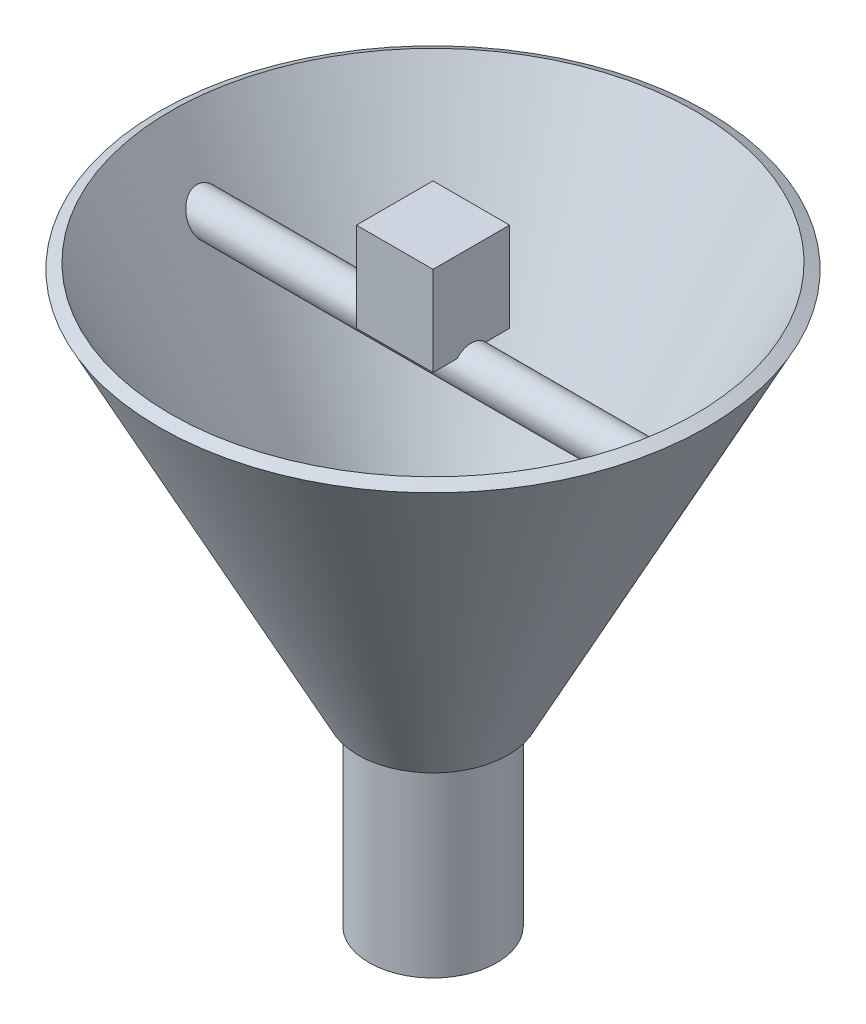
ISO-10303-21;
HEADER;
FILE_DESCRIPTION(('STEP AP214'),'2;1');
FILE_NAME('part.step','',(''),(''),'','','');
FILE_SCHEMA(('AUTOMOTIVE_DESIGN { 1 0 10303 214 1 1 1 1 }'));
ENDSEC;
DATA;
#1=APPLICATION_CONTEXT('core data for automotive mechanical design processes');
#2=APPLICATION_PROTOCOL_DEFINITION('international standard','automotive_design',2000,#1);
#3=PRODUCT_CONTEXT('',#1,'mechanical');
#4=PRODUCT('Part','Part','',(#3));
#5=PRODUCT_RELATED_PRODUCT_CATEGORY('part','',(#4));
#6=PRODUCT_DEFINITION_FORMATION('','',#4);
#7=PRODUCT_DEFINITION_CONTEXT('part definition',#1,'design');
#8=PRODUCT_DEFINITION('design','',#6,#7);
#9=PRODUCT_DEFINITION_SHAPE('','',#8);
#10=(LENGTH_UNIT() NAMED_UNIT(*) SI_UNIT(.MILLI.,.METRE.));
#11=(NAMED_UNIT(*) PLANE_ANGLE_UNIT() SI_UNIT($,.RADIAN.));
#12=(NAMED_UNIT(*) SI_UNIT($,.STERADIAN.) SOLID_ANGLE_UNIT());
#13=UNCERTAINTY_MEASURE_WITH_UNIT(LENGTH_MEASURE(1.E-05),#10,'distance_accuracy_value','');
#14=(GEOMETRIC_REPRESENTATION_CONTEXT(3) GLOBAL_UNCERTAINTY_ASSIGNED_CONTEXT((#13)) GLOBAL_UNIT_ASSIGNED_CONTEXT((#10,
#11,#12)) REPRESENTATION_CONTEXT('',''));
#15=CARTESIAN_POINT('',(0.,0.,0.));
#16=DIRECTION('',(0.,0.,1.));
#17=DIRECTION('',(1.,0.,0.));
#18=AXIS2_PLACEMENT_3D('',#15,#16,#17);
#19=CARTESIAN_POINT('',(0.,0.,0.));
#20=DIRECTION('',(0.,-1.,0.));
#21=DIRECTION('',(0.,0.,-1.));
#22=AXIS2_PLACEMENT_3D('',#19,#20,#21);
#23=PLANE('',#22);
#24=CARTESIAN_POINT('',(0.,0.,0.));
#25=DIRECTION('',(0.,-1.,0.));
#26=DIRECTION('',(0.,0.,-1.));
#27=AXIS2_PLACEMENT_3D('',#24,#25,#26);
#28=CIRCLE('',#27,4.5);
#29=CARTESIAN_POINT('',(0.,0.,-4.5));
#30=VERTEX_POINT('',#29);
#31=EDGE_CURVE('E75',#30,#30,#28,.T.);
#32=ORIENTED_EDGE('',*,*,#31,.T.);
#33=EDGE_LOOP('',(#32));
#34=FACE_BOUND('',#33,.T.);
#35=CARTESIAN_POINT('',(0.,0.,0.));
#36=DIRECTION('',(0.,1.,0.));
#37=DIRECTION('',(0.,0.,1.));
#38=AXIS2_PLACEMENT_3D('',#35,#36,#37);
#39=CIRCLE('',#38,5.);
#40=CARTESIAN_POINT('',(0.,0.,5.));
#41=VERTEX_POINT('',#40);
#42=EDGE_CURVE('E71',#41,#41,#39,.T.);
#43=ORIENTED_EDGE('',*,*,#42,.T.);
#44=EDGE_LOOP('',(#43));
#45=FACE_BOUND('',#44,.T.);
#46=ADVANCED_FACE('F65',(#34,#45),#23,.F.);
#47=CARTESIAN_POINT('',(0.,-15.,0.));
#48=DIRECTION('',(0.,-1.,0.));
#49=DIRECTION('',(0.,0.,-1.));
#50=AXIS2_PLACEMENT_3D('',#47,#48,#49);
#51=PLANE('',#50);
#52=CARTESIAN_POINT('',(0.,-15.,0.));
#53=DIRECTION('',(0.,-1.,0.));
#54=DIRECTION('',(0.,0.,-1.));
#55=AXIS2_PLACEMENT_3D('',#52,#53,#54);
#56=CIRCLE('',#55,4.5);
#57=CARTESIAN_POINT('',(0.,-15.,-4.5));
#58=VERTEX_POINT('',#57);
#59=EDGE_CURVE('E79',#58,#58,#56,.T.);
#60=ORIENTED_EDGE('',*,*,#59,.F.);
#61=EDGE_LOOP('',(#60));
#62=FACE_BOUND('',#61,.T.);
#63=CARTESIAN_POINT('',(0.,-15.,0.));
#64=DIRECTION('',(0.,1.,0.));
#65=DIRECTION('',(0.,0.,1.));
#66=AXIS2_PLACEMENT_3D('',#63,#64,#65);
#67=CIRCLE('',#66,5.);
#68=CARTESIAN_POINT('',(0.,-15.,5.));
#69=VERTEX_POINT('',#68);
#70=EDGE_CURVE('E12',#69,#69,#67,.T.);
#71=ORIENTED_EDGE('',*,*,#70,.F.);
#72=EDGE_LOOP('',(#71));
#73=FACE_BOUND('',#72,.T.);
#74=ADVANCED_FACE('F87',(#62,#73),#51,.T.);
#75=CARTESIAN_POINT('',(0.,0.,0.));
#76=DIRECTION('',(0.,-1.,0.));
#77=DIRECTION('',(0.,0.,-1.));
#78=AXIS2_PLACEMENT_3D('',#75,#76,#77);
#79=CYLINDRICAL_SURFACE('',#78,5.);
#80=ORIENTED_EDGE('',*,*,#42,.F.);
#81=EDGE_LOOP('',(#80));
#82=FACE_BOUND('',#81,.T.);
#83=ORIENTED_EDGE('',*,*,#70,.T.);
#84=EDGE_LOOP('',(#83));
#85=FACE_BOUND('',#84,.T.);
#86=ADVANCED_FACE('F90',(#82,#85),#79,.T.);
#87=CARTESIAN_POINT('',(0.,0.,0.));
#88=DIRECTION('',(0.,-1.,0.));
#89=DIRECTION('',(0.,0.,-1.));
#90=AXIS2_PLACEMENT_3D('',#87,#88,#89);
#91=CYLINDRICAL_SURFACE('',#90,4.5);
#92=ORIENTED_EDGE('',*,*,#31,.F.);
#93=EDGE_LOOP('',(#92));
#94=FACE_BOUND('',#93,.T.);
#95=ORIENTED_EDGE('',*,*,#59,.T.);
#96=EDGE_LOOP('',(#95));
#97=FACE_BOUND('',#96,.T.);
#98=ADVANCED_FACE('F85',(#94,#97),#91,.F.);
#99=CLOSED_SHELL('',(#46,#74,#86,#98));
#100=MANIFOLD_SOLID_BREP('B2',#99);
#101=CARTESIAN_POINT('',(-3.,25.539732044708,-3.));
#102=DIRECTION('',(0.,0.,-1.));
#103=DIRECTION('',(-1.,0.,0.));
#104=AXIS2_PLACEMENT_3D('',#101,#102,#103);
#105=PLANE('',#104);
#106=DIRECTION('',(1.,0.,0.));
#107=VECTOR('',#106,1.);
#108=CARTESIAN_POINT('',(-3.,32.539732044708,-3.));
#109=LINE('',#108,#107);
#110=CARTESIAN_POINT('',(-3.,32.539732044708,-3.));
#111=VERTEX_POINT('',#110);
#112=CARTESIAN_POINT('',(3.,32.539732044708,-3.));
#113=VERTEX_POINT('',#112);
#114=EDGE_CURVE('E137',#111,#113,#109,.T.);
#115=ORIENTED_EDGE('',*,*,#114,.T.);
#116=DIRECTION('',(0.,1.,0.));
#117=VECTOR('',#116,1.);
#118=CARTESIAN_POINT('',(3.,25.539732044708,-3.));
#119=LINE('',#118,#117);
#120=CARTESIAN_POINT('',(3.,25.539732044708,-3.));
#121=VERTEX_POINT('',#120);
#122=EDGE_CURVE('E174',#121,#113,#119,.T.);
#123=ORIENTED_EDGE('',*,*,#122,.F.);
#124=DIRECTION('',(1.,0.,0.));
#125=VECTOR('',#124,1.);
#126=CARTESIAN_POINT('',(-3.,25.539732044708,-3.));
#127=LINE('',#126,#125);
#128=CARTESIAN_POINT('',(-3.,25.539732044708,-3.));
#129=VERTEX_POINT('',#128);
#130=EDGE_CURVE('E63',#129,#121,#127,.T.);
#131=ORIENTED_EDGE('',*,*,#130,.F.);
#132=DIRECTION('',(0.,1.,0.));
#133=VECTOR('',#132,1.);
#134=CARTESIAN_POINT('',(-3.,25.539732044708,-3.));
#135=LINE('',#134,#133);
#136=EDGE_CURVE('E175',#129,#111,#135,.T.);
#137=ORIENTED_EDGE('',*,*,#136,.T.);
#138=EDGE_LOOP('',(#115,#123,#131,#137));
#139=FACE_BOUND('',#138,.T.);
#140=ADVANCED_FACE('F134',(#139),#105,.T.);
#141=CARTESIAN_POINT('',(-3.,25.539732044708,-3.));
#142=DIRECTION('',(0.,-1.,0.));
#143=DIRECTION('',(0.,0.,-1.));
#144=AXIS2_PLACEMENT_3D('',#141,#142,#143);
#145=PLANE('',#144);
#146=ORIENTED_EDGE('',*,*,#130,.T.);
#147=DIRECTION('',(0.,0.,-1.));
#148=VECTOR('',#147,1.);
#149=CARTESIAN_POINT('',(3.,25.539732044708,-3.));
#150=LINE('',#149,#148);
#151=CARTESIAN_POINT('',(3.,25.539732044708,3.));
#152=VERTEX_POINT('',#151);
#153=EDGE_CURVE('E191',#152,#121,#150,.T.);
#154=ORIENTED_EDGE('',*,*,#153,.F.);
#155=DIRECTION('',(1.,0.,0.));
#156=VECTOR('',#155,1.);
#157=CARTESIAN_POINT('',(-3.,25.539732044708,3.));
#158=LINE('',#157,#156);
#159=CARTESIAN_POINT('',(-3.,25.539732044708,3.));
#160=VERTEX_POINT('',#159);
#161=EDGE_CURVE('E142',#160,#152,#158,.T.);
#162=ORIENTED_EDGE('',*,*,#161,.F.);
#163=DIRECTION('',(0.,0.,-1.));
#164=VECTOR('',#163,1.);
#165=CARTESIAN_POINT('',(-3.,25.539732044708,-3.));
#166=LINE('',#165,#164);
#167=EDGE_CURVE('E180',#160,#129,#166,.T.);
#168=ORIENTED_EDGE('',*,*,#167,.T.);
#169=EDGE_LOOP('',(#146,#154,#162,#168));
#170=FACE_BOUND('',#169,.T.);
#171=ADVANCED_FACE('F206',(#170),#145,.T.);
#172=CARTESIAN_POINT('',(-3.,25.539732044708,3.));
#173=DIRECTION('',(0.,0.,1.));
#174=DIRECTION('',(0.,-1.,0.));
#175=AXIS2_PLACEMENT_3D('',#172,#173,#174);
#176=PLANE('',#175);
#177=ORIENTED_EDGE('',*,*,#161,.T.);
#178=DIRECTION('',(0.,-1.,0.));
#179=VECTOR('',#178,1.);
#180=CARTESIAN_POINT('',(3.,25.539732044708,3.));
#181=LINE('',#180,#179);
#182=CARTESIAN_POINT('',(3.,32.539732044708,3.));
#183=VERTEX_POINT('',#182);
#184=EDGE_CURVE('E187',#183,#152,#181,.T.);
#185=ORIENTED_EDGE('',*,*,#184,.F.);
#186=DIRECTION('',(1.,0.,0.));
#187=VECTOR('',#186,1.);
#188=CARTESIAN_POINT('',(-3.,32.539732044708,3.));
#189=LINE('',#188,#187);
#190=CARTESIAN_POINT('',(-3.,32.539732044708,3.));
#191=VERTEX_POINT('',#190);
#192=EDGE_CURVE('E179',#191,#183,#189,.T.);
#193=ORIENTED_EDGE('',*,*,#192,.F.);
#194=DIRECTION('',(0.,-1.,0.));
#195=VECTOR('',#194,1.);
#196=CARTESIAN_POINT('',(-3.,25.539732044708,3.));
#197=LINE('',#196,#195);
#198=EDGE_CURVE('E199',#191,#160,#197,.T.);
#199=ORIENTED_EDGE('',*,*,#198,.T.);
#200=EDGE_LOOP('',(#177,#185,#193,#199));
#201=FACE_BOUND('',#200,.T.);
#202=ADVANCED_FACE('F203',(#201),#176,.T.);
#203=CARTESIAN_POINT('',(-3.,32.539732044708,-3.));
#204=DIRECTION('',(0.,1.,0.));
#205=DIRECTION('',(0.,0.,1.));
#206=AXIS2_PLACEMENT_3D('',#203,#204,#205);
#207=PLANE('',#206);
#208=ORIENTED_EDGE('',*,*,#192,.T.);
#209=DIRECTION('',(0.,0.,1.));
#210=VECTOR('',#209,1.);
#211=CARTESIAN_POINT('',(3.,32.539732044708,-3.));
#212=LINE('',#211,#210);
#213=EDGE_CURVE('E182',#113,#183,#212,.T.);
#214=ORIENTED_EDGE('',*,*,#213,.F.);
#215=ORIENTED_EDGE('',*,*,#114,.F.);
#216=DIRECTION('',(0.,0.,1.));
#217=VECTOR('',#216,1.);
#218=CARTESIAN_POINT('',(-3.,32.539732044708,-3.));
#219=LINE('',#218,#217);
#220=EDGE_CURVE('E197',#111,#191,#219,.T.);
#221=ORIENTED_EDGE('',*,*,#220,.T.);
#222=EDGE_LOOP('',(#208,#214,#215,#221));
#223=FACE_BOUND('',#222,.T.);
#224=ADVANCED_FACE('F183',(#223),#207,.T.);
#225=CARTESIAN_POINT('',(-3.,0.,0.));
#226=DIRECTION('',(1.,0.,0.));
#227=DIRECTION('',(0.,0.,-1.));
#228=AXIS2_PLACEMENT_3D('',#225,#226,#227);
#229=PLANE('',#228);
#230=ORIENTED_EDGE('',*,*,#136,.F.);
#231=ORIENTED_EDGE('',*,*,#167,.F.);
#232=ORIENTED_EDGE('',*,*,#198,.F.);
#233=ORIENTED_EDGE('',*,*,#220,.F.);
#234=EDGE_LOOP('',(#230,#231,#232,#233));
#235=FACE_BOUND('',#234,.T.);
#236=ADVANCED_FACE('F208',(#235),#229,.F.);
#237=CARTESIAN_POINT('',(3.,0.,0.));
#238=DIRECTION('',(1.,0.,0.));
#239=DIRECTION('',(0.,0.,-1.));
#240=AXIS2_PLACEMENT_3D('',#237,#238,#239);
#241=PLANE('',#240);
#242=ORIENTED_EDGE('',*,*,#122,.T.);
#243=ORIENTED_EDGE('',*,*,#213,.T.);
#244=ORIENTED_EDGE('',*,*,#184,.T.);
#245=ORIENTED_EDGE('',*,*,#153,.T.);
#246=EDGE_LOOP('',(#242,#243,#244,#245));
#247=FACE_BOUND('',#246,.T.);
#248=ADVANCED_FACE('F190',(#247),#241,.T.);
#249=CLOSED_SHELL('',(#140,#171,#202,#224,#236,#248));
#250=MANIFOLD_SOLID_BREP('B7',#249);
#251=CARTESIAN_POINT('',(0.,-0.460267955291984,0.));
#252=DIRECTION('',(0.,1.,0.));
#253=DIRECTION('',(0.,0.,1.));
#254=AXIS2_PLACEMENT_3D('',#251,#252,#253);
#255=CONICAL_SURFACE('',#254,5.88778004558074,0.478297001128365);
#256=CARTESIAN_POINT('',(0.,29.539732044708,0.));
#257=DIRECTION('',(0.,-1.,0.));
#258=DIRECTION('',(0.,0.,-1.));
#259=AXIS2_PLACEMENT_3D('',#256,#257,#258);
#260=CIRCLE('',#259,21.4412256625377);
#261=CARTESIAN_POINT('',(0.,29.539732044708,21.4412256625377));
#262=VERTEX_POINT('',#261);
#263=EDGE_CURVE('E272',#262,#262,#260,.T.);
#264=CARTESIAN_POINT('',(0.,-0.460267955291984,0.));
#265=DIRECTION('',(0.,-1.,0.));
#266=DIRECTION('',(0.,0.,-1.));
#267=AXIS2_PLACEMENT_3D('',#264,#265,#266);
#268=CIRCLE('',#267,5.88778004558074);
#269=CARTESIAN_POINT('',(0.,-0.460267955291984,5.88778004558074));
#270=VERTEX_POINT('',#269);
#271=EDGE_CURVE('E133',#270,#270,#268,.T.);
#272=CARTESIAN_POINT('',(0.,29.539732044708,21.4412256625377));
#273=CARTESIAN_POINT('',(0.,29.227232044708,21.2792106040277));
#274=CARTESIAN_POINT('',(0.,28.914732044708,21.1171955455177));
#275=CARTESIAN_POINT('',(0.,28.289732044708,20.7931654284978));
#276=CARTESIAN_POINT('',(0.,27.977232044708,20.6311503699878));
#277=CARTESIAN_POINT('',(0.,27.352232044708,20.3071202529679));
#278=CARTESIAN_POINT('',(0.,27.039732044708,20.1451051944579));
#279=CARTESIAN_POINT('',(0.,26.414732044708,19.821075077438));
#280=CARTESIAN_POINT('',(0.,26.102232044708,19.659060018928));
#281=CARTESIAN_POINT('',(0.,25.477232044708,19.3350299019081));
#282=CARTESIAN_POINT('',(0.,25.164732044708,19.1730148433981));
#283=CARTESIAN_POINT('',(0.,24.539732044708,18.8489847263782));
#284=CARTESIAN_POINT('',(0.,24.227232044708,18.6869696678682));
#285=CARTESIAN_POINT('',(0.,23.602232044708,18.3629395508483));
#286=CARTESIAN_POINT('',(0.,23.289732044708,18.2009244923383));
#287=CARTESIAN_POINT('',(0.,22.664732044708,17.8768943753184));
#288=CARTESIAN_POINT('',(0.,22.352232044708,17.7148793168084));
#289=CARTESIAN_POINT('',(0.,21.727232044708,17.3908491997885));
#290=CARTESIAN_POINT('',(0.,21.414732044708,17.2288341412785));
#291=CARTESIAN_POINT('',(0.,20.789732044708,16.9048040242586));
#292=CARTESIAN_POINT('',(0.,20.477232044708,16.7427889657486));
#293=CARTESIAN_POINT('',(0.,19.852232044708,16.4187588487286));
#294=CARTESIAN_POINT('',(0.,19.539732044708,16.2567437902187));
#295=CARTESIAN_POINT('',(0.,18.914732044708,15.9327136731987));
#296=CARTESIAN_POINT('',(0.,18.602232044708,15.7706986146888));
#297=CARTESIAN_POINT('',(0.,17.977232044708,15.4466684976688));
#298=CARTESIAN_POINT('',(0.,17.664732044708,15.2846534391589));
#299=CARTESIAN_POINT('',(0.,17.039732044708,14.9606233221389));
#300=CARTESIAN_POINT('',(0.,16.727232044708,14.798608263629));
#301=CARTESIAN_POINT('',(0.,16.102232044708,14.474578146609));
#302=CARTESIAN_POINT('',(0.,15.789732044708,14.3125630880991));
#303=CARTESIAN_POINT('',(0.,15.164732044708,13.9885329710791));
#304=CARTESIAN_POINT('',(0.,14.852232044708,13.8265179125692));
#305=CARTESIAN_POINT('',(0.,14.227232044708,13.5024877955492));
#306=CARTESIAN_POINT('',(0.,13.914732044708,13.3404727370393));
#307=CARTESIAN_POINT('',(0.,13.289732044708,13.0164426200193));
#308=CARTESIAN_POINT('',(0.,12.977232044708,12.8544275615094));
#309=CARTESIAN_POINT('',(0.,12.352232044708,12.5303974444894));
#310=CARTESIAN_POINT('',(0.,12.039732044708,12.3683823859795));
#311=CARTESIAN_POINT('',(0.,11.414732044708,12.0443522689595));
#312=CARTESIAN_POINT('',(0.,11.102232044708,11.8823372104495));
#313=CARTESIAN_POINT('',(0.,10.477232044708,11.5583070934296));
#314=CARTESIAN_POINT('',(0.,10.164732044708,11.3962920349196));
#315=CARTESIAN_POINT('',(0.,9.53973204470802,11.0722619178997));
#316=CARTESIAN_POINT('',(0.,9.22723204470802,10.9102468593897));
#317=CARTESIAN_POINT('',(0.,8.60223204470802,10.5862167423698));
#318=CARTESIAN_POINT('',(0.,8.28973204470802,10.4242016838598));
#319=CARTESIAN_POINT('',(0.,7.66473204470802,10.1001715668399));
#320=CARTESIAN_POINT('',(0.,7.35223204470802,9.93815650832994));
#321=CARTESIAN_POINT('',(0.,6.72723204470802,9.61412639131));
#322=CARTESIAN_POINT('',(0.,6.41473204470802,9.45211133280003));
#323=CARTESIAN_POINT('',(0.,5.78973204470802,9.1280812157801));
#324=CARTESIAN_POINT('',(0.,5.47723204470802,8.96606615727013));
#325=CARTESIAN_POINT('',(0.,4.85223204470802,8.64203604025019));
#326=CARTESIAN_POINT('',(0.,4.53973204470802,8.48002098174022));
#327=CARTESIAN_POINT('',(0.,3.91473204470802,8.15599086472029));
#328=CARTESIAN_POINT('',(0.,3.60223204470802,7.99397580621032));
#329=CARTESIAN_POINT('',(0.,2.97723204470802,7.66994568919038));
#330=CARTESIAN_POINT('',(0.,2.66473204470802,7.50793063068042));
#331=CARTESIAN_POINT('',(0.,2.03973204470802,7.18390051366048));
#332=CARTESIAN_POINT('',(0.,1.72723204470802,7.02188545515051));
#333=CARTESIAN_POINT('',(0.,1.10223204470802,6.69785533813058));
#334=CARTESIAN_POINT('',(0.,0.789732044708017,6.53584027962061));
#335=CARTESIAN_POINT('',(0.,0.164732044708016,6.21181016260067));
#336=CARTESIAN_POINT('',(0.,-0.147767955291984,6.04979510409071));
#337=CARTESIAN_POINT('',(0.,-0.460267955291984,5.88778004558074));
#338=B_SPLINE_CURVE_WITH_KNOTS('',3,(#272,#273,#274,#275,#276,#277,#278,#279,#280,#281,#282,
#283,#284,#285,#286,#287,#288,#289,#290,#291,#292,#293,#294,#295,#296,#297,#298,#299,#300,#301,
#302,#303,#304,#305,#306,#307,#308,#309,#310,#311,#312,#313,#314,#315,#316,#317,#318,#319,#320,
#321,#322,#323,#324,#325,#326,#327,#328,#329,#330,#331,#332,#333,#334,#335,#336,#337),
.UNSPECIFIED.,.F.,.F.,(4,2,2,2,2,2,2,2,2,2,2,2,2,2,2,2,2,2,2,2,2,2,2,2,2,2,2,2,2,2,2,2,4),(0.,
1.05600481185262,2.11200962370525,3.16801443555787,4.2240192474105,5.28002405926312,
6.33602887111574,7.39203368296837,8.44803849482099,9.50404330667362,10.5600481185262,
11.6160529303789,12.6720577422315,13.7280625540841,14.7840673659367,15.8400721777894,
16.896076989642,17.9520818014946,19.0080866133472,20.0640914251999,21.1200962370525,
22.1761010489051,23.2321058607577,24.2881106726104,25.344115484463,26.4001202963156,
27.4561251081682,28.5121299200209,29.5681347318735,30.6241395437261,31.6801443555787,
32.7361491674314,33.792153979284),.UNSPECIFIED.);
#339=EDGE_CURVE('BSEAM258',#262,#270,#338,.T.);
#340=ORIENTED_EDGE('',*,*,#263,.T.);
#341=ORIENTED_EDGE('',*,*,#271,.F.);
#342=ORIENTED_EDGE('',*,*,#339,.T.);
#343=ORIENTED_EDGE('',*,*,#339,.F.);
#344=EDGE_LOOP('',(#340,#342,#341,#343));
#345=FACE_BOUND('',#344,.T.);
#346=ADVANCED_FACE('F258',(#345),#255,.T.);
#347=CARTESIAN_POINT('',(0.,-0.460267955291984,0.));
#348=DIRECTION('',(0.,-1.,0.));
#349=DIRECTION('',(0.,0.,-1.));
#350=AXIS2_PLACEMENT_3D('',#347,#348,#349);
#351=CONICAL_SURFACE('',#350,5.88778004558074,1.09249932566653);
#352=CARTESIAN_POINT('',(0.,0.,0.));
#353=DIRECTION('',(0.,-1.,0.));
#354=DIRECTION('',(0.,0.,-1.));
#355=AXIS2_PLACEMENT_3D('',#352,#353,#354);
#356=CIRCLE('',#355,5.);
#357=CARTESIAN_POINT('',(0.,0.,-5.));
#358=VERTEX_POINT('',#357);
#359=EDGE_CURVE('E264',#358,#358,#356,.T.);
#360=ORIENTED_EDGE('',*,*,#359,.F.);
#361=EDGE_LOOP('',(#360));
#362=FACE_BOUND('',#361,.T.);
#363=ORIENTED_EDGE('',*,*,#271,.T.);
#364=EDGE_LOOP('',(#363));
#365=FACE_BOUND('',#364,.T.);
#366=ADVANCED_FACE('F301',(#362,#365),#351,.F.);
#367=CARTESIAN_POINT('',(0.,0.,0.));
#368=DIRECTION('',(0.,1.,0.));
#369=DIRECTION('',(0.,0.,1.));
#370=AXIS2_PLACEMENT_3D('',#367,#368,#369);
#371=CONICAL_SURFACE('',#370,5.,0.478297001128365);
#372=CARTESIAN_POINT('',(-17.1825556942128,23.5717281908149,-1.14584839261053));
#373=CARTESIAN_POINT('',(-17.2146931277636,23.6410982533897,-1.20444569082847));
#374=CARTESIAN_POINT('',(-17.2494642962117,23.7151878658877,-1.25620328454886));
#375=CARTESIAN_POINT('',(-17.3232141471198,23.8699036985298,-1.34511386551809));
#376=CARTESIAN_POINT('',(-17.3622033285952,23.9505460990728,-1.38222928939321));
#377=CARTESIAN_POINT('',(-17.4431006552132,24.1152927941173,-1.44134365207669));
#378=CARTESIAN_POINT('',(-17.4849950056298,24.199380043709,-1.463409274798));
#379=CARTESIAN_POINT('',(-17.5707822581943,24.3690181459417,-1.49273883424918));
#380=CARTESIAN_POINT('',(-17.6146743898882,24.4545684265434,-1.50000842851196));
#381=CARTESIAN_POINT('',(-17.706885434778,24.6317865658986,-1.49999090467804));
#382=CARTESIAN_POINT('',(-17.7552836294251,24.7234141988874,-1.49153087766614));
#383=CARTESIAN_POINT('',(-17.8518759659463,24.9037578829236,-1.458048068741));
#384=CARTESIAN_POINT('',(-17.9000699851777,24.9924723544979,-1.4330164526495));
#385=CARTESIAN_POINT('',(-17.9965028868866,25.1677901987633,-1.3655342361168));
#386=CARTESIAN_POINT('',(-18.0446790099623,25.2541978557742,-1.32248033700783));
#387=CARTESIAN_POINT('',(-18.1373455327326,25.4185699338081,-1.21944478392064));
#388=CARTESIAN_POINT('',(-18.1818361710354,25.4965349015342,-1.1594642269299));
#389=CARTESIAN_POINT('',(-18.2625689006771,25.6367356870821,-1.0272937069241));
#390=CARTESIAN_POINT('',(-18.2991353050421,25.6996119528086,-0.955986792051245));
#391=CARTESIAN_POINT('',(-18.3648587548801,25.8118882923964,-0.800487009151952));
#392=CARTESIAN_POINT('',(-18.3940253806774,25.8613057971652,-0.71631103116418));
#393=CARTESIAN_POINT('',(-18.4393809771574,25.937825982675,-0.550018306941468));
#394=CARTESIAN_POINT('',(-18.4568066082185,25.9670691030088,-0.469225573319813));
#395=CARTESIAN_POINT('',(-18.4832853283799,26.0114200638138,-0.3025604429347));
#396=CARTESIAN_POINT('',(-18.4923479020502,26.026543917218,-0.216693918309996));
#397=CARTESIAN_POINT('',(-18.5007953941046,26.0406400676601,-0.0547079327714315));
#398=CARTESIAN_POINT('',(-18.5013030443779,26.0414861723321,0.0211963286861554));
#399=CARTESIAN_POINT('',(-18.4954681659656,26.0317513283617,0.171989500850724));
#400=CARTESIAN_POINT('',(-18.4891273076972,26.0211731662082,0.246878654641976));
#401=CARTESIAN_POINT('',(-18.470363117551,25.9897853058744,0.390576089262263));
#402=CARTESIAN_POINT('',(-18.4581839022656,25.9693861135136,0.459507504703789));
#403=CARTESIAN_POINT('',(-18.4284996097268,25.9194813937609,0.592753126917055));
#404=CARTESIAN_POINT('',(-18.4109935708268,25.8899742221001,0.657066497404199));
#405=CARTESIAN_POINT('',(-18.3701617437474,25.8208189461594,0.783810917948878));
#406=CARTESIAN_POINT('',(-18.3465334389517,25.7806395582291,0.845853077839455));
#407=CARTESIAN_POINT('',(-18.2951203962402,25.6926652956637,0.962330098744287));
#408=CARTESIAN_POINT('',(-18.2673338414129,25.644867091455,1.0167616141424));
#409=CARTESIAN_POINT('',(-18.2048566688592,25.5366129516818,1.12370776433035));
#410=CARTESIAN_POINT('',(-18.1697372337111,25.4753213304342,1.17512513067858));
#411=CARTESIAN_POINT('',(-18.0966403423408,25.3465547065923,1.26700521246979));
#412=CARTESIAN_POINT('',(-18.0586613882641,25.2790764592743,1.30746213494666));
#413=CARTESIAN_POINT('',(-17.9757887654582,25.1303022244712,1.38166996186091));
#414=CARTESIAN_POINT('',(-17.9306424911018,25.0483559753521,1.41383978490319));
#415=CARTESIAN_POINT('',(-17.8394007281902,24.8805932977866,1.46337673961738));
#416=CARTESIAN_POINT('',(-17.7933047921405,24.7947750210189,1.48073672135498));
#417=CARTESIAN_POINT('',(-17.6976961724311,24.6142963548729,1.50110956648828));
#418=CARTESIAN_POINT('',(-17.6482056948505,24.5194784908618,1.50286125884882));
#419=CARTESIAN_POINT('',(-17.550995390485,24.3302761299838,1.48833140632416));
#420=CARTESIAN_POINT('',(-17.5032758076065,24.2358916943704,1.47204738682582));
#421=CARTESIAN_POINT('',(-17.411372879817,24.0511654114565,1.42140931941639));
#422=CARTESIAN_POINT('',(-17.3671661012907,23.9607989311,1.38718909638674));
#423=CARTESIAN_POINT('',(-17.2833162311541,23.7866783363976,1.30089779231108));
#424=CARTESIAN_POINT('',(-17.2436708300386,23.7029208825952,1.24883579846666));
#425=CARTESIAN_POINT('',(-17.1733324962914,23.5521389249152,1.13267938416377));
#426=CARTESIAN_POINT('',(-17.1421721083337,23.4843055916194,1.06992108842164));
#427=CARTESIAN_POINT('',(-17.0858826279614,23.3603321058554,0.93146618696674));
#428=CARTESIAN_POINT('',(-17.0607489566576,23.3041830803721,0.855779479158705));
#429=CARTESIAN_POINT('',(-17.0196507897421,23.2115390675739,0.702207129148019));
#430=CARTESIAN_POINT('',(-17.0030044142006,23.1736071021836,0.625369402132086));
#431=CARTESIAN_POINT('',(-16.9757590585117,23.1111861955046,0.465417093392562));
#432=CARTESIAN_POINT('',(-16.9651568334745,23.0866900412742,0.382305906858783));
#433=CARTESIAN_POINT('',(-16.9509006245962,23.0536765910663,0.219150562558744));
#434=CARTESIAN_POINT('',(-16.9467725359503,23.0440696808698,0.139366595377849));
#435=CARTESIAN_POINT('',(-16.9440500073469,23.0377386016927,-0.0207931297047899));
#436=CARTESIAN_POINT('',(-16.9454538995613,23.0410105498852,-0.101168701951267));
#437=CARTESIAN_POINT('',(-16.9536224339023,23.0599788857793,-0.257571895361994));
#438=CARTESIAN_POINT('',(-16.9602171785035,23.0752814894163,-0.33365677114167));
#439=CARTESIAN_POINT('',(-16.9783920221425,23.1172034112262,-0.482033834209085));
#440=CARTESIAN_POINT('',(-16.9899736634898,23.1438262303975,-0.554324840391563));
#441=CARTESIAN_POINT('',(-17.0180455805404,23.2078331656521,-0.69430763322158));
#442=CARTESIAN_POINT('',(-17.0346085456935,23.2453763493523,-0.761911682400425));
#443=CARTESIAN_POINT('',(-17.0721565339154,23.3296335863249,-0.889666172317003));
#444=CARTESIAN_POINT('',(-17.0931362247948,23.3763365766117,-0.949825463089844));
#445=CARTESIAN_POINT('',(-17.1263846638194,23.4495199122339,-1.03081991896736));
#446=CARTESIAN_POINT('',(-17.1371010402604,23.4730014893242,-1.055090710758));
#447=CARTESIAN_POINT('',(-17.1592782392677,23.521352248674,-1.10183182433584));
#448=CARTESIAN_POINT('',(-17.170738926963,23.5462211794273,-1.12430247067458));
#449=CARTESIAN_POINT('',(-17.1825556942128,23.5717281908149,-1.14584839261053));
#450=B_SPLINE_CURVE_WITH_KNOTS('',3,(#372,#373,#374,#375,#376,#377,#378,#379,#380,#381,#382,
#383,#384,#385,#386,#387,#388,#389,#390,#391,#392,#393,#394,#395,#396,#397,#398,#399,#400,#401,
#402,#403,#404,#405,#406,#407,#408,#409,#410,#411,#412,#413,#414,#415,#416,#417,#418,#419,#420,
#421,#422,#423,#424,#425,#426,#427,#428,#429,#430,#431,#432,#433,#434,#435,#436,#437,#438,#439,
#440,#441,#442,#443,#444,#445,#446,#447,#448,#449),.UNSPECIFIED.,.T.,.F.,(4,2,2,2,2,2,2,2,2,2,2,
2,2,2,2,2,2,2,2,2,2,2,2,2,2,2,2,2,2,2,2,2,2,2,2,2,2,2,4),(0.,0.288837129901256,
0.578410504519344,0.86669232950205,1.15486390391642,1.46538899928412,1.77607976647628,
2.09812776775878,2.42015490245748,2.7239579379287,3.02736561596307,3.28882946113032,
3.54999641358884,3.77657499016698,4.00309831452389,4.22088178569654,4.43870459646535,
4.67057528357675,4.90254758200639,5.16362331907199,5.42483677549931,5.72039451261135,
6.0160948592482,6.33549090340005,6.65493077612778,6.97202048954038,7.28894894170302,
7.57989849191864,7.870626283389,8.13110868657425,8.39145111399323,8.63165155697669,
8.8717795878514,9.10435941075789,9.33701121590713,9.57323784452093,9.80918090220986,
9.91540400781377,10.021607918955),.UNSPECIFIED.);
#451=CARTESIAN_POINT('',(-17.1825556942128,23.5717281908149,-1.14584839261053));
#452=VERTEX_POINT('',#451);
#453=EDGE_CURVE('E277',#452,#452,#450,.T.);
#454=ORIENTED_EDGE('',*,*,#453,.F.);
#455=EDGE_LOOP('',(#454));
#456=FACE_BOUND('',#455,.T.);
#457=CARTESIAN_POINT('',(17.1126876606992,23.419367625876,-0.997388374212959));
#458=CARTESIAN_POINT('',(17.1394404657405,23.4783117109855,-1.06359289741756));
#459=CARTESIAN_POINT('',(17.1689742446476,23.5426641014078,-1.12401615894313));
#460=CARTESIAN_POINT('',(17.2327095066949,23.6795323180258,-1.23194584200045));
#461=CARTESIAN_POINT('',(17.2669224458991,23.7520681009722,-1.27941967745324));
#462=CARTESIAN_POINT('',(17.3388807830407,23.9023609087533,-1.36051880979116));
#463=CARTESIAN_POINT('',(17.3766090778275,23.9800921821775,-1.39420725804316));
#464=CARTESIAN_POINT('',(17.4547748930962,24.1387751835995,-1.44784374976028));
#465=CARTESIAN_POINT('',(17.4952114216889,24.2197257281758,-1.46779679393888));
#466=CARTESIAN_POINT('',(17.5812714288893,24.3895695619218,-1.49513866380155));
#467=CARTESIAN_POINT('',(17.6270488390927,24.4785716873703,-1.501368557656));
#468=CARTESIAN_POINT('',(17.7195497292474,24.6558238192536,-1.49812849136437));
#469=CARTESIAN_POINT('',(17.7662737046952,24.7440733955133,-1.48865008708093));
#470=CARTESIAN_POINT('',(17.8625493348899,24.9235041390919,-1.45314480818155));
#471=CARTESIAN_POINT('',(17.9120816149553,25.0144879425668,-1.42605582071693));
#472=CARTESIAN_POINT('',(18.0092101073902,25.1906578679618,-1.35474274506656));
#473=CARTESIAN_POINT('',(18.0568057983452,25.2758424325745,-1.31051407542206));
#474=CARTESIAN_POINT('',(18.1476987854118,25.4367634696991,-1.20600115830094));
#475=CARTESIAN_POINT('',(18.1910370946806,25.5125923762021,-1.14589620935674));
#476=CARTESIAN_POINT('',(18.2718604598722,25.6527746420702,-1.01025986124183));
#477=CARTESIAN_POINT('',(18.3093498283269,25.7171364613493,-0.934739923574147));
#478=CARTESIAN_POINT('',(18.372473253281,25.8248019351738,-0.778833947507657));
#479=CARTESIAN_POINT('',(18.3989486747844,25.8696258569806,-0.699844607268345));
#480=CARTESIAN_POINT('',(18.4435070645769,25.9447712619185,-0.533095543827445));
#481=CARTESIAN_POINT('',(18.4616022273425,25.9751138194855,-0.445348791517834));
#482=CARTESIAN_POINT('',(18.4859721582226,26.0159049021738,-0.27786436455795));
#483=CARTESIAN_POINT('',(18.4936048322494,26.028641298183,-0.198876890353475));
#484=CARTESIAN_POINT('',(18.5012117666396,26.0413349021222,-0.0395289185440657));
#485=CARTESIAN_POINT('',(18.5011905656603,26.0412996834684,0.0408307371009232));
#486=CARTESIAN_POINT('',(18.4938433198824,26.0290391210293,0.19308413824124));
#487=CARTESIAN_POINT('',(18.4871612742171,26.0178884642706,0.265099793558229));
#488=CARTESIAN_POINT('',(18.4678349985375,25.9855515290097,0.405992535191902));
#489=CARTESIAN_POINT('',(18.4551906739237,25.9643650912762,0.474869571691181));
#490=CARTESIAN_POINT('',(18.4242778689668,25.9123697245669,0.609233185795634));
#491=CARTESIAN_POINT('',(18.4058982030811,25.881370373603,0.674619843130157));
#492=CARTESIAN_POINT('',(18.3644608073128,25.8111287566361,0.799167074673075));
#493=CARTESIAN_POINT('',(18.3414014832441,25.7718836814591,0.858325516700714));
#494=CARTESIAN_POINT('',(18.2888927266416,25.6819756268782,0.975332083137016));
#495=CARTESIAN_POINT('',(18.259028428435,25.6305502643297,1.03240659633662));
#496=CARTESIAN_POINT('',(18.1957969654337,25.5208118289728,1.13721057471561));
#497=CARTESIAN_POINT('',(18.1624280448137,25.4624953018239,1.18493532099844));
#498=CARTESIAN_POINT('',(18.088481519967,25.3321167850503,1.27644019590267));
#499=CARTESIAN_POINT('',(18.0475407008401,25.2592640061361,1.31880137062334));
#500=CARTESIAN_POINT('',(17.9637317424111,25.1084443352664,1.39052082414739));
#501=CARTESIAN_POINT('',(17.9208626037398,25.0304747816621,1.41987227299196));
#502=CARTESIAN_POINT('',(17.8295573389784,24.8623629687621,1.46777483317661));
#503=CARTESIAN_POINT('',(17.7810286199417,24.7718265101979,1.48477803705095));
#504=CARTESIAN_POINT('',(17.6844091610349,24.5889098616034,1.50200717550065));
#505=CARTESIAN_POINT('',(17.6363185804505,24.4965290371761,1.50222723423583));
#506=CARTESIAN_POINT('',(17.5402776661368,24.3091757103868,1.48525762201968));
#507=CARTESIAN_POINT('',(17.4923896613779,24.2142240257491,1.46746579193964));
#508=CARTESIAN_POINT('',(17.3999811951501,24.0279970661968,1.41333690299448));
#509=CARTESIAN_POINT('',(17.3554600183146,23.9367210122405,1.37700379646996));
#510=CARTESIAN_POINT('',(17.273465267738,23.7659298766525,1.28840657511439));
#511=CARTESIAN_POINT('',(17.2357440075102,23.6860485591376,1.23708231168375));
#512=CARTESIAN_POINT('',(17.1658767601444,23.5360126086929,1.11877303486652));
#513=CARTESIAN_POINT('',(17.1337267480481,23.4658509611821,1.05179941023236));
#514=CARTESIAN_POINT('',(17.0790670621149,23.3451379696982,0.911390961022311));
#515=CARTESIAN_POINT('',(17.0559109412538,23.2933204342201,0.839296601495928));
#516=CARTESIAN_POINT('',(17.0157603915501,23.2027181096024,0.685797648422276));
#517=CARTESIAN_POINT('',(16.9987618545315,23.1639246324271,0.604399310115229));
#518=CARTESIAN_POINT('',(16.9727688164042,23.104287718099,0.442946798827934));
#519=CARTESIAN_POINT('',(16.9631728088612,23.0821012498935,0.363483556322842));
#520=CARTESIAN_POINT('',(16.9497695745864,23.0510504336992,0.201532562469305));
#521=CARTESIAN_POINT('',(16.9459598405508,23.0421803154989,0.119046137002073));
#522=CARTESIAN_POINT('',(16.9442800674978,23.0382729503945,-0.0418909451251256));
#523=CARTESIAN_POINT('',(16.9461041273002,23.0425232879908,-0.120322254302186));
#524=CARTESIAN_POINT('',(16.9549852361914,23.0631401096243,-0.275290491406434));
#525=CARTESIAN_POINT('',(16.9620433811474,23.0795091309644,-0.351827019152525));
#526=CARTESIAN_POINT('',(16.9811566493677,23.1235609969937,-0.500439307743537));
#527=CARTESIAN_POINT('',(16.9931850912656,23.1511834206107,-0.572536560107406));
#528=CARTESIAN_POINT('',(17.0219286547342,23.2166423625395,-0.710825322254172));
#529=CARTESIAN_POINT('',(17.038637545512,23.2544652990632,-0.777024530358075));
#530=CARTESIAN_POINT('',(17.0658552319576,23.3154639310171,-0.867352011355726));
#531=CARTESIAN_POINT('',(17.0746617579245,23.3351260372748,-0.894447375444837));
#532=CARTESIAN_POINT('',(17.0930786798335,23.3760629994496,-0.947093630013357));
#533=CARTESIAN_POINT('',(17.1026889398924,23.3973375826971,-0.972644780311591));
#534=CARTESIAN_POINT('',(17.1126876606992,23.419367625876,-0.997388374212959));
#535=B_SPLINE_CURVE_WITH_KNOTS('',3,(#457,#458,#459,#460,#461,#462,#463,#464,#465,#466,#467,
#468,#469,#470,#471,#472,#473,#474,#475,#476,#477,#478,#479,#480,#481,#482,#483,#484,#485,#486,
#487,#488,#489,#490,#491,#492,#493,#494,#495,#496,#497,#498,#499,#500,#501,#502,#503,#504,#505,
#506,#507,#508,#509,#510,#511,#512,#513,#514,#515,#516,#517,#518,#519,#520,#521,#522,#523,#524,
#525,#526,#527,#528,#529,#530,#531,#532,#533,#534),.UNSPECIFIED.,.T.,.F.,(4,2,2,2,2,2,2,2,2,2,2,
2,2,2,2,2,2,2,2,2,2,2,2,2,2,2,2,2,2,2,2,2,2,2,2,2,2,2,4),(0.,0.277635633664905,
0.555963599130934,0.833001861508307,1.10993920783608,1.40948922326973,1.70920031675302,
2.028911910862,2.34870902329747,2.66503842699847,2.98113348156245,3.26323536226752,
3.54492544445676,3.78471386620159,4.02436009648545,4.24288438361992,4.4614121380514,
4.6844712787534,4.90760653538173,5.15390653384145,5.40033052328415,5.68026481188167,
5.96034588924627,6.27131241667731,6.58238781412176,6.90421783400695,7.22597927981844,
7.5307939985684,7.83538757687834,8.10914585869837,8.3827211584157,8.63061870161846,
8.87840879536294,9.11298547635131,9.3476112848268,9.58099361731351,9.81406672687472,
9.91784910186384,10.0216139662481),.UNSPECIFIED.);
#536=CARTESIAN_POINT('',(17.1126876606992,23.419367625876,-0.997388374212959));
#537=VERTEX_POINT('',#536);
#538=EDGE_CURVE('E285',#537,#537,#535,.T.);
#539=ORIENTED_EDGE('',*,*,#538,.T.);
#540=EDGE_LOOP('',(#539));
#541=FACE_BOUND('',#540,.T.);
#542=CARTESIAN_POINT('',(0.,30.,0.));
#543=DIRECTION('',(0.,-1.,0.));
#544=DIRECTION('',(0.,0.,-1.));
#545=AXIS2_PLACEMENT_3D('',#542,#543,#544);
#546=CIRCLE('',#545,20.5534456169569);
#547=CARTESIAN_POINT('',(0.,30.,-20.5534456169569));
#548=VERTEX_POINT('',#547);
#549=EDGE_CURVE('E268',#548,#548,#546,.T.);
#550=ORIENTED_EDGE('',*,*,#549,.F.);
#551=EDGE_LOOP('',(#550));
#552=FACE_BOUND('',#551,.T.);
#553=ORIENTED_EDGE('',*,*,#359,.T.);
#554=EDGE_LOOP('',(#553));
#555=FACE_BOUND('',#554,.T.);
#556=ADVANCED_FACE('F298',(#456,#541,#552,#555),#371,.F.);
#557=CARTESIAN_POINT('',(0.,30.,0.));
#558=DIRECTION('',(0.,-1.,0.));
#559=DIRECTION('',(0.,0.,-1.));
#560=AXIS2_PLACEMENT_3D('',#557,#558,#559);
#561=CONICAL_SURFACE('',#560,20.5534456169569,1.09249932566655);
#562=ORIENTED_EDGE('',*,*,#263,.F.);
#563=EDGE_LOOP('',(#562));
#564=FACE_BOUND('',#563,.T.);
#565=ORIENTED_EDGE('',*,*,#549,.T.);
#566=EDGE_LOOP('',(#565));
#567=FACE_BOUND('',#566,.T.);
#568=ADVANCED_FACE('F295',(#564,#567),#561,.T.);
#569=CARTESIAN_POINT('',(-21.4432256625377,24.539732044708,0.));
#570=DIRECTION('',(1.,0.,0.));
#571=DIRECTION('',(0.,0.,-1.));
#572=AXIS2_PLACEMENT_3D('',#569,#570,#571);
#573=CYLINDRICAL_SURFACE('',#572,1.5);
#574=ORIENTED_EDGE('',*,*,#453,.T.);
#575=EDGE_LOOP('',(#574));
#576=FACE_BOUND('',#575,.T.);
#577=ORIENTED_EDGE('',*,*,#538,.F.);
#578=EDGE_LOOP('',(#577));
#579=FACE_BOUND('',#578,.T.);
#580=ADVANCED_FACE('F291',(#576,#579),#573,.T.);
#581=CLOSED_SHELL('',(#346,#366,#556,#568,#580));
#582=MANIFOLD_SOLID_BREP('B57',#581);
#583=ADVANCED_BREP_SHAPE_REPRESENTATION('',(#18,#100,#250,#582),#14);
#584=SHAPE_DEFINITION_REPRESENTATION(#9,#583);
ENDSEC;
END-ISO-10303-21;
